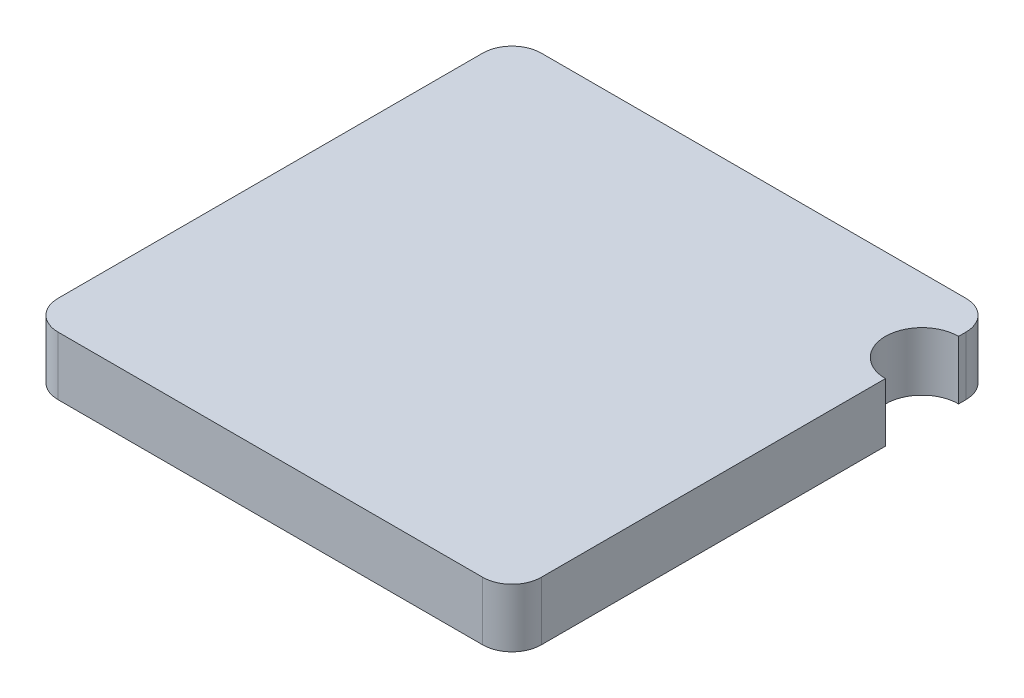
ISO-10303-21;
HEADER;
FILE_DESCRIPTION(('STEP AP214'),'2;1');
FILE_NAME('part.step','',(''),(''),'','','');
FILE_SCHEMA(('AUTOMOTIVE_DESIGN { 1 0 10303 214 1 1 1 1 }'));
ENDSEC;
DATA;
#1=APPLICATION_CONTEXT('core data for automotive mechanical design processes');
#2=APPLICATION_PROTOCOL_DEFINITION('international standard','automotive_design',2000,#1);
#3=PRODUCT_CONTEXT('',#1,'mechanical');
#4=PRODUCT('Part','Part','',(#3));
#5=PRODUCT_RELATED_PRODUCT_CATEGORY('part','',(#4));
#6=PRODUCT_DEFINITION_FORMATION('','',#4);
#7=PRODUCT_DEFINITION_CONTEXT('part definition',#1,'design');
#8=PRODUCT_DEFINITION('design','',#6,#7);
#9=PRODUCT_DEFINITION_SHAPE('','',#8);
#10=(LENGTH_UNIT() NAMED_UNIT(*) SI_UNIT(.MILLI.,.METRE.));
#11=(NAMED_UNIT(*) PLANE_ANGLE_UNIT() SI_UNIT($,.RADIAN.));
#12=(NAMED_UNIT(*) SI_UNIT($,.STERADIAN.) SOLID_ANGLE_UNIT());
#13=UNCERTAINTY_MEASURE_WITH_UNIT(LENGTH_MEASURE(1.E-05),#10,'distance_accuracy_value','');
#14=(GEOMETRIC_REPRESENTATION_CONTEXT(3) GLOBAL_UNCERTAINTY_ASSIGNED_CONTEXT((#13)) GLOBAL_UNIT_ASSIGNED_CONTEXT((#10,
#11,#12)) REPRESENTATION_CONTEXT('',''));
#15=CARTESIAN_POINT('',(0.,0.,0.));
#16=DIRECTION('',(0.,0.,1.));
#17=DIRECTION('',(1.,0.,0.));
#18=AXIS2_PLACEMENT_3D('',#15,#16,#17);
#19=CARTESIAN_POINT('',(0.825,0.2,0.825));
#20=DIRECTION('',(-1.,0.,0.));
#21=DIRECTION('',(0.,0.,1.));
#22=AXIS2_PLACEMENT_3D('',#19,#20,#21);
#23=PLANE('',#22);
#24=DIRECTION('',(0.,0.,-1.));
#25=VECTOR('',#24,1.);
#26=CARTESIAN_POINT('',(0.825,0.,0.825));
#27=LINE('',#26,#25);
#28=CARTESIAN_POINT('',(0.825,0.,0.725));
#29=VERTEX_POINT('',#28);
#30=CARTESIAN_POINT('',(0.825,0.,-0.45));
#31=VERTEX_POINT('',#30);
#32=EDGE_CURVE('E138',#29,#31,#27,.T.);
#33=ORIENTED_EDGE('',*,*,#32,.T.);
#34=DIRECTION('',(0.,1.,0.));
#35=VECTOR('',#34,1.);
#36=CARTESIAN_POINT('',(0.825,0.,-0.45));
#37=LINE('',#36,#35);
#38=CARTESIAN_POINT('',(0.825,0.2,-0.45));
#39=VERTEX_POINT('',#38);
#40=EDGE_CURVE('E54',#31,#39,#37,.T.);
#41=ORIENTED_EDGE('',*,*,#40,.T.);
#42=DIRECTION('',(0.,0.,-1.));
#43=VECTOR('',#42,1.);
#44=CARTESIAN_POINT('',(0.825,0.2,0.825));
#45=LINE('',#44,#43);
#46=CARTESIAN_POINT('',(0.825,0.2,0.725));
#47=VERTEX_POINT('',#46);
#48=EDGE_CURVE('E227',#47,#39,#45,.T.);
#49=ORIENTED_EDGE('',*,*,#48,.F.);
#50=DIRECTION('',(0.,-1.,0.));
#51=VECTOR('',#50,1.);
#52=CARTESIAN_POINT('',(0.825,0.2,0.725));
#53=LINE('',#52,#51);
#54=EDGE_CURVE('E161',#47,#29,#53,.T.);
#55=ORIENTED_EDGE('',*,*,#54,.T.);
#56=EDGE_LOOP('',(#33,#41,#49,#55));
#57=FACE_BOUND('',#56,.T.);
#58=ADVANCED_FACE('F39',(#57),#23,.F.);
#59=CARTESIAN_POINT('',(0.825,0.2,-0.7));
#60=VERTEX_POINT('',#59);
#61=CARTESIAN_POINT('',(0.825,0.2,-0.725));
#62=VERTEX_POINT('',#61);
#63=EDGE_CURVE('E129',#60,#62,#45,.T.);
#64=ORIENTED_EDGE('',*,*,#63,.F.);
#65=DIRECTION('',(0.,1.,0.));
#66=VECTOR('',#65,1.);
#67=CARTESIAN_POINT('',(0.825,0.,-0.7));
#68=LINE('',#67,#66);
#69=CARTESIAN_POINT('',(0.825,0.,-0.7));
#70=VERTEX_POINT('',#69);
#71=EDGE_CURVE('E117',#60,#70,#68,.F.);
#72=ORIENTED_EDGE('',*,*,#71,.T.);
#73=CARTESIAN_POINT('',(0.825,0.,-0.725));
#74=VERTEX_POINT('',#73);
#75=EDGE_CURVE('E127',#70,#74,#27,.T.);
#76=ORIENTED_EDGE('',*,*,#75,.T.);
#77=DIRECTION('',(0.,-1.,0.));
#78=VECTOR('',#77,1.);
#79=CARTESIAN_POINT('',(0.825,0.2,-0.725));
#80=LINE('',#79,#78);
#81=EDGE_CURVE('E158',#74,#62,#80,.F.);
#82=ORIENTED_EDGE('',*,*,#81,.T.);
#83=EDGE_LOOP('',(#64,#72,#76,#82));
#84=FACE_BOUND('',#83,.T.);
#85=ADVANCED_FACE('F125',(#84),#23,.F.);
#86=CARTESIAN_POINT('',(-0.825,0.2,-0.825));
#87=DIRECTION('',(0.,0.,1.));
#88=DIRECTION('',(1.,0.,0.));
#89=AXIS2_PLACEMENT_3D('',#86,#87,#88);
#90=PLANE('',#89);
#91=DIRECTION('',(-1.,0.,0.));
#92=VECTOR('',#91,1.);
#93=CARTESIAN_POINT('',(-0.825,0.2,-0.825));
#94=LINE('',#93,#92);
#95=CARTESIAN_POINT('',(0.725,0.2,-0.825));
#96=VERTEX_POINT('',#95);
#97=CARTESIAN_POINT('',(-0.725,0.2,-0.825));
#98=VERTEX_POINT('',#97);
#99=EDGE_CURVE('E224',#96,#98,#94,.T.);
#100=ORIENTED_EDGE('',*,*,#99,.F.);
#101=DIRECTION('',(0.,-1.,0.));
#102=VECTOR('',#101,1.);
#103=CARTESIAN_POINT('',(0.725,0.2,-0.825));
#104=LINE('',#103,#102);
#105=CARTESIAN_POINT('',(0.725,0.,-0.825));
#106=VERTEX_POINT('',#105);
#107=EDGE_CURVE('E198',#96,#106,#104,.T.);
#108=ORIENTED_EDGE('',*,*,#107,.T.);
#109=DIRECTION('',(-1.,0.,0.));
#110=VECTOR('',#109,1.);
#111=CARTESIAN_POINT('',(-0.825,0.,-0.825));
#112=LINE('',#111,#110);
#113=CARTESIAN_POINT('',(-0.725,0.,-0.825));
#114=VERTEX_POINT('',#113);
#115=EDGE_CURVE('E142',#106,#114,#112,.T.);
#116=ORIENTED_EDGE('',*,*,#115,.T.);
#117=DIRECTION('',(0.,-1.,0.));
#118=VECTOR('',#117,1.);
#119=CARTESIAN_POINT('',(-0.725,0.2,-0.825));
#120=LINE('',#119,#118);
#121=EDGE_CURVE('E195',#114,#98,#120,.F.);
#122=ORIENTED_EDGE('',*,*,#121,.T.);
#123=EDGE_LOOP('',(#100,#108,#116,#122));
#124=FACE_BOUND('',#123,.T.);
#125=ADVANCED_FACE('F256',(#124),#90,.F.);
#126=CARTESIAN_POINT('',(-0.825,0.2,0.825));
#127=DIRECTION('',(1.,0.,0.));
#128=DIRECTION('',(0.,0.,-1.));
#129=AXIS2_PLACEMENT_3D('',#126,#127,#128);
#130=PLANE('',#129);
#131=DIRECTION('',(0.,0.,1.));
#132=VECTOR('',#131,1.);
#133=CARTESIAN_POINT('',(-0.825,0.2,0.825));
#134=LINE('',#133,#132);
#135=CARTESIAN_POINT('',(-0.825,0.2,-0.725));
#136=VERTEX_POINT('',#135);
#137=CARTESIAN_POINT('',(-0.825,0.2,0.725));
#138=VERTEX_POINT('',#137);
#139=EDGE_CURVE('E208',#136,#138,#134,.T.);
#140=ORIENTED_EDGE('',*,*,#139,.F.);
#141=DIRECTION('',(0.,-1.,0.));
#142=VECTOR('',#141,1.);
#143=CARTESIAN_POINT('',(-0.825,0.2,-0.725));
#144=LINE('',#143,#142);
#145=CARTESIAN_POINT('',(-0.825,0.,-0.725));
#146=VERTEX_POINT('',#145);
#147=EDGE_CURVE('E48',#136,#146,#144,.T.);
#148=ORIENTED_EDGE('',*,*,#147,.T.);
#149=DIRECTION('',(0.,0.,1.));
#150=VECTOR('',#149,1.);
#151=CARTESIAN_POINT('',(-0.825,0.,0.825));
#152=LINE('',#151,#150);
#153=CARTESIAN_POINT('',(-0.825,0.,0.725));
#154=VERTEX_POINT('',#153);
#155=EDGE_CURVE('E151',#146,#154,#152,.T.);
#156=ORIENTED_EDGE('',*,*,#155,.T.);
#157=DIRECTION('',(0.,-1.,0.));
#158=VECTOR('',#157,1.);
#159=CARTESIAN_POINT('',(-0.825,0.2,0.725));
#160=LINE('',#159,#158);
#161=EDGE_CURVE('E62',#154,#138,#160,.F.);
#162=ORIENTED_EDGE('',*,*,#161,.T.);
#163=EDGE_LOOP('',(#140,#148,#156,#162));
#164=FACE_BOUND('',#163,.T.);
#165=ADVANCED_FACE('F207',(#164),#130,.F.);
#166=CARTESIAN_POINT('',(-0.825,0.2,0.825));
#167=DIRECTION('',(0.,0.,-1.));
#168=DIRECTION('',(-1.,0.,0.));
#169=AXIS2_PLACEMENT_3D('',#166,#167,#168);
#170=PLANE('',#169);
#171=DIRECTION('',(1.,0.,0.));
#172=VECTOR('',#171,1.);
#173=CARTESIAN_POINT('',(-0.825,0.,0.825));
#174=LINE('',#173,#172);
#175=CARTESIAN_POINT('',(-0.725,0.,0.825));
#176=VERTEX_POINT('',#175);
#177=CARTESIAN_POINT('',(0.725,0.,0.825));
#178=VERTEX_POINT('',#177);
#179=EDGE_CURVE('E154',#176,#178,#174,.T.);
#180=ORIENTED_EDGE('',*,*,#179,.T.);
#181=DIRECTION('',(0.,-1.,0.));
#182=VECTOR('',#181,1.);
#183=CARTESIAN_POINT('',(0.725,0.2,0.825));
#184=LINE('',#183,#182);
#185=CARTESIAN_POINT('',(0.725,0.2,0.825));
#186=VERTEX_POINT('',#185);
#187=EDGE_CURVE('E180',#178,#186,#184,.F.);
#188=ORIENTED_EDGE('',*,*,#187,.T.);
#189=DIRECTION('',(1.,0.,0.));
#190=VECTOR('',#189,1.);
#191=CARTESIAN_POINT('',(-0.825,0.2,0.825));
#192=LINE('',#191,#190);
#193=CARTESIAN_POINT('',(-0.725,0.2,0.825));
#194=VERTEX_POINT('',#193);
#195=EDGE_CURVE('E146',#194,#186,#192,.T.);
#196=ORIENTED_EDGE('',*,*,#195,.F.);
#197=DIRECTION('',(0.,-1.,0.));
#198=VECTOR('',#197,1.);
#199=CARTESIAN_POINT('',(-0.725,0.2,0.825));
#200=LINE('',#199,#198);
#201=EDGE_CURVE('E176',#194,#176,#200,.T.);
#202=ORIENTED_EDGE('',*,*,#201,.T.);
#203=EDGE_LOOP('',(#180,#188,#196,#202));
#204=FACE_BOUND('',#203,.T.);
#205=ADVANCED_FACE('F217',(#204),#170,.F.);
#206=CARTESIAN_POINT('',(0.,0.2,0.));
#207=DIRECTION('',(0.,-1.,0.));
#208=DIRECTION('',(0.,0.,-1.));
#209=AXIS2_PLACEMENT_3D('',#206,#207,#208);
#210=PLANE('',#209);
#211=ORIENTED_EDGE('',*,*,#48,.T.);
#212=CARTESIAN_POINT('',(0.825,0.2,-0.575));
#213=DIRECTION('',(0.,1.,0.));
#214=DIRECTION('',(0.,0.,1.));
#215=AXIS2_PLACEMENT_3D('',#212,#213,#214);
#216=CIRCLE('',#215,0.125);
#217=EDGE_CURVE('E131',#60,#39,#216,.T.);
#218=ORIENTED_EDGE('',*,*,#217,.F.);
#219=ORIENTED_EDGE('',*,*,#63,.T.);
#220=CARTESIAN_POINT('',(0.725,0.2,-0.725));
#221=DIRECTION('',(0.,-1.,0.));
#222=DIRECTION('',(0.,0.,-1.));
#223=AXIS2_PLACEMENT_3D('',#220,#221,#222);
#224=CIRCLE('',#223,0.1);
#225=EDGE_CURVE('E189',#62,#96,#224,.F.);
#226=ORIENTED_EDGE('',*,*,#225,.T.);
#227=ORIENTED_EDGE('',*,*,#99,.T.);
#228=CARTESIAN_POINT('',(-0.725,0.2,-0.725));
#229=DIRECTION('',(0.,-1.,0.));
#230=DIRECTION('',(0.,0.,-1.));
#231=AXIS2_PLACEMENT_3D('',#228,#229,#230);
#232=CIRCLE('',#231,0.1);
#233=EDGE_CURVE('E186',#98,#136,#232,.F.);
#234=ORIENTED_EDGE('',*,*,#233,.T.);
#235=ORIENTED_EDGE('',*,*,#139,.T.);
#236=CARTESIAN_POINT('',(-0.725,0.2,0.725));
#237=DIRECTION('',(0.,-1.,0.));
#238=DIRECTION('',(0.,0.,-1.));
#239=AXIS2_PLACEMENT_3D('',#236,#237,#238);
#240=CIRCLE('',#239,0.1);
#241=EDGE_CURVE('E183',#138,#194,#240,.F.);
#242=ORIENTED_EDGE('',*,*,#241,.T.);
#243=ORIENTED_EDGE('',*,*,#195,.T.);
#244=CARTESIAN_POINT('',(0.725,0.2,0.725));
#245=DIRECTION('',(0.,-1.,0.));
#246=DIRECTION('',(0.,0.,-1.));
#247=AXIS2_PLACEMENT_3D('',#244,#245,#246);
#248=CIRCLE('',#247,0.1);
#249=EDGE_CURVE('E192',#186,#47,#248,.F.);
#250=ORIENTED_EDGE('',*,*,#249,.T.);
#251=EDGE_LOOP('',(#211,#218,#219,#226,#227,#234,#235,#242,#243,#250));
#252=FACE_BOUND('',#251,.T.);
#253=ADVANCED_FACE('F237',(#252),#210,.F.);
#254=CARTESIAN_POINT('',(0.,0.,0.));
#255=DIRECTION('',(0.,-1.,0.));
#256=DIRECTION('',(0.,0.,-1.));
#257=AXIS2_PLACEMENT_3D('',#254,#255,#256);
#258=PLANE('',#257);
#259=CARTESIAN_POINT('',(0.825,0.,-0.575));
#260=DIRECTION('',(0.,-1.,0.));
#261=DIRECTION('',(0.,0.,-1.));
#262=AXIS2_PLACEMENT_3D('',#259,#260,#261);
#263=CIRCLE('',#262,0.125);
#264=EDGE_CURVE('E11',#31,#70,#263,.T.);
#265=ORIENTED_EDGE('',*,*,#264,.F.);
#266=ORIENTED_EDGE('',*,*,#32,.F.);
#267=CARTESIAN_POINT('',(0.725,0.,0.725));
#268=DIRECTION('',(0.,-1.,0.));
#269=DIRECTION('',(0.,0.,-1.));
#270=AXIS2_PLACEMENT_3D('',#267,#268,#269);
#271=CIRCLE('',#270,0.1);
#272=EDGE_CURVE('E173',#29,#178,#271,.T.);
#273=ORIENTED_EDGE('',*,*,#272,.T.);
#274=ORIENTED_EDGE('',*,*,#179,.F.);
#275=CARTESIAN_POINT('',(-0.725,0.,0.725));
#276=DIRECTION('',(0.,-1.,0.));
#277=DIRECTION('',(0.,0.,-1.));
#278=AXIS2_PLACEMENT_3D('',#275,#276,#277);
#279=CIRCLE('',#278,0.1);
#280=EDGE_CURVE('E165',#176,#154,#279,.T.);
#281=ORIENTED_EDGE('',*,*,#280,.T.);
#282=ORIENTED_EDGE('',*,*,#155,.F.);
#283=CARTESIAN_POINT('',(-0.725,0.,-0.725));
#284=DIRECTION('',(0.,-1.,0.));
#285=DIRECTION('',(0.,0.,-1.));
#286=AXIS2_PLACEMENT_3D('',#283,#284,#285);
#287=CIRCLE('',#286,0.1);
#288=EDGE_CURVE('E168',#146,#114,#287,.T.);
#289=ORIENTED_EDGE('',*,*,#288,.T.);
#290=ORIENTED_EDGE('',*,*,#115,.F.);
#291=CARTESIAN_POINT('',(0.725,0.,-0.725));
#292=DIRECTION('',(0.,-1.,0.));
#293=DIRECTION('',(0.,0.,-1.));
#294=AXIS2_PLACEMENT_3D('',#291,#292,#293);
#295=CIRCLE('',#294,0.1);
#296=EDGE_CURVE('E135',#106,#74,#295,.T.);
#297=ORIENTED_EDGE('',*,*,#296,.T.);
#298=ORIENTED_EDGE('',*,*,#75,.F.);
#299=EDGE_LOOP('',(#265,#266,#273,#274,#281,#282,#289,#290,#297,#298));
#300=FACE_BOUND('',#299,.T.);
#301=ADVANCED_FACE('F133',(#300),#258,.T.);
#302=CARTESIAN_POINT('',(0.725,0.2,0.725));
#303=DIRECTION('',(0.,-1.,0.));
#304=DIRECTION('',(0.,0.,-1.));
#305=AXIS2_PLACEMENT_3D('',#302,#303,#304);
#306=CYLINDRICAL_SURFACE('',#305,0.1);
#307=ORIENTED_EDGE('',*,*,#249,.F.);
#308=ORIENTED_EDGE('',*,*,#187,.F.);
#309=ORIENTED_EDGE('',*,*,#272,.F.);
#310=ORIENTED_EDGE('',*,*,#54,.F.);
#311=EDGE_LOOP('',(#307,#308,#309,#310));
#312=FACE_BOUND('',#311,.T.);
#313=ADVANCED_FACE('F239',(#312),#306,.T.);
#314=CARTESIAN_POINT('',(0.725,0.2,-0.725));
#315=DIRECTION('',(0.,-1.,0.));
#316=DIRECTION('',(0.,0.,-1.));
#317=AXIS2_PLACEMENT_3D('',#314,#315,#316);
#318=CYLINDRICAL_SURFACE('',#317,0.1);
#319=ORIENTED_EDGE('',*,*,#225,.F.);
#320=ORIENTED_EDGE('',*,*,#81,.F.);
#321=ORIENTED_EDGE('',*,*,#296,.F.);
#322=ORIENTED_EDGE('',*,*,#107,.F.);
#323=EDGE_LOOP('',(#319,#320,#321,#322));
#324=FACE_BOUND('',#323,.T.);
#325=ADVANCED_FACE('F241',(#324),#318,.T.);
#326=CARTESIAN_POINT('',(-0.725,0.2,-0.725));
#327=DIRECTION('',(0.,-1.,0.));
#328=DIRECTION('',(0.,0.,-1.));
#329=AXIS2_PLACEMENT_3D('',#326,#327,#328);
#330=CYLINDRICAL_SURFACE('',#329,0.1);
#331=ORIENTED_EDGE('',*,*,#233,.F.);
#332=ORIENTED_EDGE('',*,*,#121,.F.);
#333=ORIENTED_EDGE('',*,*,#288,.F.);
#334=ORIENTED_EDGE('',*,*,#147,.F.);
#335=EDGE_LOOP('',(#331,#332,#333,#334));
#336=FACE_BOUND('',#335,.T.);
#337=ADVANCED_FACE('F247',(#336),#330,.T.);
#338=CARTESIAN_POINT('',(-0.725,0.2,0.725));
#339=DIRECTION('',(0.,-1.,0.));
#340=DIRECTION('',(0.,0.,-1.));
#341=AXIS2_PLACEMENT_3D('',#338,#339,#340);
#342=CYLINDRICAL_SURFACE('',#341,0.1);
#343=ORIENTED_EDGE('',*,*,#241,.F.);
#344=ORIENTED_EDGE('',*,*,#161,.F.);
#345=ORIENTED_EDGE('',*,*,#280,.F.);
#346=ORIENTED_EDGE('',*,*,#201,.F.);
#347=EDGE_LOOP('',(#343,#344,#345,#346));
#348=FACE_BOUND('',#347,.T.);
#349=ADVANCED_FACE('F41',(#348),#342,.T.);
#350=CARTESIAN_POINT('',(0.825,0.,-0.575));
#351=DIRECTION('',(0.,1.,0.));
#352=DIRECTION('',(0.,0.,1.));
#353=AXIS2_PLACEMENT_3D('',#350,#351,#352);
#354=CYLINDRICAL_SURFACE('',#353,0.125);
#355=ORIENTED_EDGE('',*,*,#264,.T.);
#356=ORIENTED_EDGE('',*,*,#71,.F.);
#357=ORIENTED_EDGE('',*,*,#217,.T.);
#358=ORIENTED_EDGE('',*,*,#40,.F.);
#359=EDGE_LOOP('',(#355,#356,#357,#358));
#360=FACE_BOUND('',#359,.T.);
#361=ADVANCED_FACE('F116',(#360),#354,.F.);
#362=CLOSED_SHELL('',(#58,#85,#125,#165,#205,#253,#301,#313,#325,#337,#349,#361));
#363=MANIFOLD_SOLID_BREP('B2',#362);
#364=ADVANCED_BREP_SHAPE_REPRESENTATION('',(#18,#363),#14);
#365=SHAPE_DEFINITION_REPRESENTATION(#9,#364);
ENDSEC;
END-ISO-10303-21;
